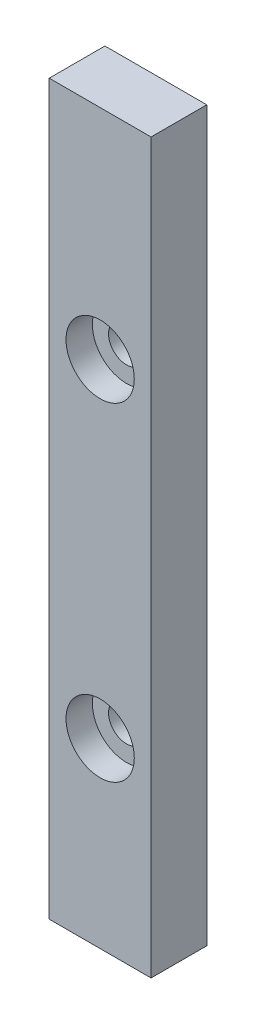
ISO-10303-21;
HEADER;
FILE_DESCRIPTION(('STEP AP214'),'2;1');
FILE_NAME('part.step','',(''),(''),'','','');
FILE_SCHEMA(('AUTOMOTIVE_DESIGN { 1 0 10303 214 1 1 1 1 }'));
ENDSEC;
DATA;
#1=APPLICATION_CONTEXT('core data for automotive mechanical design processes');
#2=APPLICATION_PROTOCOL_DEFINITION('international standard','automotive_design',2000,#1);
#3=PRODUCT_CONTEXT('',#1,'mechanical');
#4=PRODUCT('Part','Part','',(#3));
#5=PRODUCT_RELATED_PRODUCT_CATEGORY('part','',(#4));
#6=PRODUCT_DEFINITION_FORMATION('','',#4);
#7=PRODUCT_DEFINITION_CONTEXT('part definition',#1,'design');
#8=PRODUCT_DEFINITION('design','',#6,#7);
#9=PRODUCT_DEFINITION_SHAPE('','',#8);
#10=(LENGTH_UNIT() NAMED_UNIT(*) SI_UNIT(.MILLI.,.METRE.));
#11=(NAMED_UNIT(*) PLANE_ANGLE_UNIT() SI_UNIT($,.RADIAN.));
#12=(NAMED_UNIT(*) SI_UNIT($,.STERADIAN.) SOLID_ANGLE_UNIT());
#13=UNCERTAINTY_MEASURE_WITH_UNIT(LENGTH_MEASURE(1.E-05),#10,'distance_accuracy_value','');
#14=(GEOMETRIC_REPRESENTATION_CONTEXT(3) GLOBAL_UNCERTAINTY_ASSIGNED_CONTEXT((#13)) GLOBAL_UNIT_ASSIGNED_CONTEXT((#10,
#11,#12)) REPRESENTATION_CONTEXT('',''));
#15=CARTESIAN_POINT('',(0.,0.,0.));
#16=DIRECTION('',(0.,0.,1.));
#17=DIRECTION('',(1.,0.,0.));
#18=AXIS2_PLACEMENT_3D('',#15,#16,#17);
#19=CARTESIAN_POINT('',(4.25,-45.6,4.65));
#20=DIRECTION('',(0.,0.,1.));
#21=DIRECTION('',(1.,0.,0.));
#22=AXIS2_PLACEMENT_3D('',#19,#20,#21);
#23=CYLINDRICAL_SURFACE('',#22,1.5);
#24=CARTESIAN_POINT('',(4.25,-45.6,0.));
#25=DIRECTION('',(0.,0.,1.));
#26=DIRECTION('',(1.,0.,0.));
#27=AXIS2_PLACEMENT_3D('',#24,#25,#26);
#28=CIRCLE('',#27,1.5);
#29=CARTESIAN_POINT('',(5.75,-45.6,0.));
#30=VERTEX_POINT('',#29);
#31=EDGE_CURVE('E104',#30,#30,#28,.T.);
#32=ORIENTED_EDGE('',*,*,#31,.F.);
#33=EDGE_LOOP('',(#32));
#34=FACE_BOUND('',#33,.T.);
#35=CARTESIAN_POINT('',(4.25,-45.6,2.45));
#36=DIRECTION('',(0.,0.,1.));
#37=DIRECTION('',(1.,0.,0.));
#38=AXIS2_PLACEMENT_3D('',#35,#36,#37);
#39=CIRCLE('',#38,1.5);
#40=CARTESIAN_POINT('',(5.75,-45.6,2.45));
#41=VERTEX_POINT('',#40);
#42=EDGE_CURVE('E38',#41,#41,#39,.F.);
#43=ORIENTED_EDGE('',*,*,#42,.F.);
#44=EDGE_LOOP('',(#43));
#45=FACE_BOUND('',#44,.T.);
#46=ADVANCED_FACE('F34',(#34,#45),#23,.F.);
#47=CARTESIAN_POINT('',(4.25000000000001,-18.2,4.65));
#48=DIRECTION('',(0.,0.,1.));
#49=DIRECTION('',(1.,0.,0.));
#50=AXIS2_PLACEMENT_3D('',#47,#48,#49);
#51=CYLINDRICAL_SURFACE('',#50,1.5);
#52=CARTESIAN_POINT('',(4.25000000000001,-18.2,0.));
#53=DIRECTION('',(0.,0.,1.));
#54=DIRECTION('',(1.,0.,0.));
#55=AXIS2_PLACEMENT_3D('',#52,#53,#54);
#56=CIRCLE('',#55,1.5);
#57=CARTESIAN_POINT('',(5.75000000000001,-18.2,0.));
#58=VERTEX_POINT('',#57);
#59=EDGE_CURVE('E110',#58,#58,#56,.T.);
#60=ORIENTED_EDGE('',*,*,#59,.F.);
#61=EDGE_LOOP('',(#60));
#62=FACE_BOUND('',#61,.T.);
#63=CARTESIAN_POINT('',(4.25000000000001,-18.2,2.45));
#64=DIRECTION('',(0.,0.,1.));
#65=DIRECTION('',(1.,0.,0.));
#66=AXIS2_PLACEMENT_3D('',#63,#64,#65);
#67=CIRCLE('',#66,1.5);
#68=CARTESIAN_POINT('',(5.75000000000001,-18.2,2.45));
#69=VERTEX_POINT('',#68);
#70=EDGE_CURVE('E112',#69,#69,#67,.F.);
#71=ORIENTED_EDGE('',*,*,#70,.F.);
#72=EDGE_LOOP('',(#71));
#73=FACE_BOUND('',#72,.T.);
#74=ADVANCED_FACE('F140',(#62,#73),#51,.F.);
#75=CARTESIAN_POINT('',(0.,0.,4.65));
#76=DIRECTION('',(1.,0.,0.));
#77=DIRECTION('',(0.,1.,0.));
#78=AXIS2_PLACEMENT_3D('',#75,#76,#77);
#79=PLANE('',#78);
#80=DIRECTION('',(0.,-1.,0.));
#81=VECTOR('',#80,1.);
#82=CARTESIAN_POINT('',(0.,0.,0.));
#83=LINE('',#82,#81);
#84=CARTESIAN_POINT('',(0.,0.,0.));
#85=VERTEX_POINT('',#84);
#86=CARTESIAN_POINT('',(0.,-60.8,0.));
#87=VERTEX_POINT('',#86);
#88=EDGE_CURVE('E101',#85,#87,#83,.T.);
#89=ORIENTED_EDGE('',*,*,#88,.T.);
#90=DIRECTION('',(0.,0.,-1.));
#91=VECTOR('',#90,1.);
#92=CARTESIAN_POINT('',(0.,-60.8,4.65));
#93=LINE('',#92,#91);
#94=CARTESIAN_POINT('',(0.,-60.8,4.65));
#95=VERTEX_POINT('',#94);
#96=EDGE_CURVE('E11',#95,#87,#93,.T.);
#97=ORIENTED_EDGE('',*,*,#96,.F.);
#98=DIRECTION('',(0.,-1.,0.));
#99=VECTOR('',#98,1.);
#100=CARTESIAN_POINT('',(0.,0.,4.65));
#101=LINE('',#100,#99);
#102=CARTESIAN_POINT('',(0.,0.,4.65));
#103=VERTEX_POINT('',#102);
#104=EDGE_CURVE('E88',#103,#95,#101,.T.);
#105=ORIENTED_EDGE('',*,*,#104,.F.);
#106=DIRECTION('',(0.,0.,-1.));
#107=VECTOR('',#106,1.);
#108=CARTESIAN_POINT('',(0.,0.,4.65));
#109=LINE('',#108,#107);
#110=EDGE_CURVE('E97',#103,#85,#109,.T.);
#111=ORIENTED_EDGE('',*,*,#110,.T.);
#112=EDGE_LOOP('',(#89,#97,#105,#111));
#113=FACE_BOUND('',#112,.T.);
#114=ADVANCED_FACE('F36',(#113),#79,.F.);
#115=CARTESIAN_POINT('',(0.,-60.8,4.65));
#116=DIRECTION('',(0.,1.,0.));
#117=DIRECTION('',(0.,0.,1.));
#118=AXIS2_PLACEMENT_3D('',#115,#116,#117);
#119=PLANE('',#118);
#120=DIRECTION('',(1.,0.,0.));
#121=VECTOR('',#120,1.);
#122=CARTESIAN_POINT('',(0.,-60.8,0.));
#123=LINE('',#122,#121);
#124=CARTESIAN_POINT('',(8.50000000000001,-60.8,0.));
#125=VERTEX_POINT('',#124);
#126=EDGE_CURVE('E92',#87,#125,#123,.T.);
#127=ORIENTED_EDGE('',*,*,#126,.T.);
#128=DIRECTION('',(0.,0.,-1.));
#129=VECTOR('',#128,1.);
#130=CARTESIAN_POINT('',(8.50000000000001,-60.8,4.65));
#131=LINE('',#130,#129);
#132=CARTESIAN_POINT('',(8.50000000000001,-60.8,4.65));
#133=VERTEX_POINT('',#132);
#134=EDGE_CURVE('E44',#133,#125,#131,.T.);
#135=ORIENTED_EDGE('',*,*,#134,.F.);
#136=DIRECTION('',(1.,0.,0.));
#137=VECTOR('',#136,1.);
#138=CARTESIAN_POINT('',(0.,-60.8,4.65));
#139=LINE('',#138,#137);
#140=EDGE_CURVE('E83',#95,#133,#139,.T.);
#141=ORIENTED_EDGE('',*,*,#140,.F.);
#142=ORIENTED_EDGE('',*,*,#96,.T.);
#143=EDGE_LOOP('',(#127,#135,#141,#142));
#144=FACE_BOUND('',#143,.T.);
#145=ADVANCED_FACE('F91',(#144),#119,.F.);
#146=CARTESIAN_POINT('',(8.5,0.,4.65));
#147=DIRECTION('',(-1.,0.,0.));
#148=DIRECTION('',(0.,-1.,0.));
#149=AXIS2_PLACEMENT_3D('',#146,#147,#148);
#150=PLANE('',#149);
#151=DIRECTION('',(0.,1.,0.));
#152=VECTOR('',#151,1.);
#153=CARTESIAN_POINT('',(8.5,0.,0.));
#154=LINE('',#153,#152);
#155=CARTESIAN_POINT('',(8.5,0.,0.));
#156=VERTEX_POINT('',#155);
#157=EDGE_CURVE('E70',#125,#156,#154,.T.);
#158=ORIENTED_EDGE('',*,*,#157,.T.);
#159=DIRECTION('',(0.,0.,-1.));
#160=VECTOR('',#159,1.);
#161=CARTESIAN_POINT('',(8.5,0.,4.65));
#162=LINE('',#161,#160);
#163=CARTESIAN_POINT('',(8.5,0.,4.65));
#164=VERTEX_POINT('',#163);
#165=EDGE_CURVE('E93',#164,#156,#162,.T.);
#166=ORIENTED_EDGE('',*,*,#165,.F.);
#167=DIRECTION('',(0.,1.,0.));
#168=VECTOR('',#167,1.);
#169=CARTESIAN_POINT('',(8.5,0.,4.65));
#170=LINE('',#169,#168);
#171=EDGE_CURVE('E86',#133,#164,#170,.T.);
#172=ORIENTED_EDGE('',*,*,#171,.F.);
#173=ORIENTED_EDGE('',*,*,#134,.T.);
#174=EDGE_LOOP('',(#158,#166,#172,#173));
#175=FACE_BOUND('',#174,.T.);
#176=ADVANCED_FACE('F95',(#175),#150,.F.);
#177=CARTESIAN_POINT('',(0.,0.,4.65));
#178=DIRECTION('',(0.,-1.,0.));
#179=DIRECTION('',(0.,0.,-1.));
#180=AXIS2_PLACEMENT_3D('',#177,#178,#179);
#181=PLANE('',#180);
#182=DIRECTION('',(-1.,0.,0.));
#183=VECTOR('',#182,1.);
#184=CARTESIAN_POINT('',(0.,0.,0.));
#185=LINE('',#184,#183);
#186=EDGE_CURVE('E76',#156,#85,#185,.T.);
#187=ORIENTED_EDGE('',*,*,#186,.T.);
#188=ORIENTED_EDGE('',*,*,#110,.F.);
#189=DIRECTION('',(-1.,0.,0.));
#190=VECTOR('',#189,1.);
#191=CARTESIAN_POINT('',(0.,0.,4.65));
#192=LINE('',#191,#190);
#193=EDGE_CURVE('E53',#164,#103,#192,.T.);
#194=ORIENTED_EDGE('',*,*,#193,.F.);
#195=ORIENTED_EDGE('',*,*,#165,.T.);
#196=EDGE_LOOP('',(#187,#188,#194,#195));
#197=FACE_BOUND('',#196,.T.);
#198=ADVANCED_FACE('F166',(#197),#181,.F.);
#199=CARTESIAN_POINT('',(0.,0.,4.65));
#200=DIRECTION('',(0.,0.,1.));
#201=DIRECTION('',(1.,0.,0.));
#202=AXIS2_PLACEMENT_3D('',#199,#200,#201);
#203=PLANE('',#202);
#204=CARTESIAN_POINT('',(4.25000000000001,-18.2,4.65));
#205=DIRECTION('',(0.,0.,1.));
#206=DIRECTION('',(1.,0.,0.));
#207=AXIS2_PLACEMENT_3D('',#204,#205,#206);
#208=CIRCLE('',#207,2.85);
#209=CARTESIAN_POINT('',(7.10000000000001,-18.2,4.65));
#210=VERTEX_POINT('',#209);
#211=EDGE_CURVE('E119',#210,#210,#208,.T.);
#212=ORIENTED_EDGE('',*,*,#211,.F.);
#213=EDGE_LOOP('',(#212));
#214=FACE_BOUND('',#213,.T.);
#215=CARTESIAN_POINT('',(4.25,-45.6,4.65));
#216=DIRECTION('',(0.,0.,1.));
#217=DIRECTION('',(1.,0.,0.));
#218=AXIS2_PLACEMENT_3D('',#215,#216,#217);
#219=CIRCLE('',#218,2.85);
#220=CARTESIAN_POINT('',(7.1,-45.6,4.65));
#221=VERTEX_POINT('',#220);
#222=EDGE_CURVE('E129',#221,#221,#219,.T.);
#223=ORIENTED_EDGE('',*,*,#222,.F.);
#224=EDGE_LOOP('',(#223));
#225=FACE_BOUND('',#224,.T.);
#226=ORIENTED_EDGE('',*,*,#104,.T.);
#227=ORIENTED_EDGE('',*,*,#140,.T.);
#228=ORIENTED_EDGE('',*,*,#171,.T.);
#229=ORIENTED_EDGE('',*,*,#193,.T.);
#230=EDGE_LOOP('',(#226,#227,#228,#229));
#231=FACE_BOUND('',#230,.T.);
#232=ADVANCED_FACE('F84',(#214,#225,#231),#203,.T.);
#233=CARTESIAN_POINT('',(0.,0.,0.));
#234=DIRECTION('',(0.,0.,1.));
#235=DIRECTION('',(1.,0.,0.));
#236=AXIS2_PLACEMENT_3D('',#233,#234,#235);
#237=PLANE('',#236);
#238=ORIENTED_EDGE('',*,*,#59,.T.);
#239=EDGE_LOOP('',(#238));
#240=FACE_BOUND('',#239,.T.);
#241=ORIENTED_EDGE('',*,*,#31,.T.);
#242=EDGE_LOOP('',(#241));
#243=FACE_BOUND('',#242,.T.);
#244=ORIENTED_EDGE('',*,*,#88,.F.);
#245=ORIENTED_EDGE('',*,*,#186,.F.);
#246=ORIENTED_EDGE('',*,*,#157,.F.);
#247=ORIENTED_EDGE('',*,*,#126,.F.);
#248=EDGE_LOOP('',(#244,#245,#246,#247));
#249=FACE_BOUND('',#248,.T.);
#250=ADVANCED_FACE('F135',(#240,#243,#249),#237,.F.);
#251=CARTESIAN_POINT('',(4.25000000000001,-18.2,2.45));
#252=DIRECTION('',(0.,0.,1.));
#253=DIRECTION('',(1.,0.,0.));
#254=AXIS2_PLACEMENT_3D('',#251,#252,#253);
#255=PLANE('',#254);
#256=CARTESIAN_POINT('',(4.25000000000001,-18.2,2.45));
#257=DIRECTION('',(0.,0.,1.));
#258=DIRECTION('',(1.,0.,0.));
#259=AXIS2_PLACEMENT_3D('',#256,#257,#258);
#260=CIRCLE('',#259,2.85);
#261=CARTESIAN_POINT('',(7.10000000000001,-18.2,2.45));
#262=VERTEX_POINT('',#261);
#263=EDGE_CURVE('E114',#262,#262,#260,.T.);
#264=ORIENTED_EDGE('',*,*,#263,.T.);
#265=EDGE_LOOP('',(#264));
#266=FACE_BOUND('',#265,.T.);
#267=ORIENTED_EDGE('',*,*,#70,.T.);
#268=EDGE_LOOP('',(#267));
#269=FACE_BOUND('',#268,.T.);
#270=ADVANCED_FACE('F156',(#266,#269),#255,.T.);
#271=CARTESIAN_POINT('',(4.25000000000001,-18.2,2.45));
#272=DIRECTION('',(0.,0.,1.));
#273=DIRECTION('',(1.,0.,0.));
#274=AXIS2_PLACEMENT_3D('',#271,#272,#273);
#275=CYLINDRICAL_SURFACE('',#274,2.85);
#276=ORIENTED_EDGE('',*,*,#263,.F.);
#277=EDGE_LOOP('',(#276));
#278=FACE_BOUND('',#277,.T.);
#279=ORIENTED_EDGE('',*,*,#211,.T.);
#280=EDGE_LOOP('',(#279));
#281=FACE_BOUND('',#280,.T.);
#282=ADVANCED_FACE('F147',(#278,#281),#275,.F.);
#283=CARTESIAN_POINT('',(4.25,-45.6,2.45));
#284=DIRECTION('',(0.,0.,1.));
#285=DIRECTION('',(1.,0.,0.));
#286=AXIS2_PLACEMENT_3D('',#283,#284,#285);
#287=PLANE('',#286);
#288=CARTESIAN_POINT('',(4.25,-45.6,2.45));
#289=DIRECTION('',(0.,0.,1.));
#290=DIRECTION('',(1.,0.,0.));
#291=AXIS2_PLACEMENT_3D('',#288,#289,#290);
#292=CIRCLE('',#291,2.85);
#293=CARTESIAN_POINT('',(7.1,-45.6,2.45));
#294=VERTEX_POINT('',#293);
#295=EDGE_CURVE('E124',#294,#294,#292,.T.);
#296=ORIENTED_EDGE('',*,*,#295,.T.);
#297=EDGE_LOOP('',(#296));
#298=FACE_BOUND('',#297,.T.);
#299=ORIENTED_EDGE('',*,*,#42,.T.);
#300=EDGE_LOOP('',(#299));
#301=FACE_BOUND('',#300,.T.);
#302=ADVANCED_FACE('F144',(#298,#301),#287,.T.);
#303=CARTESIAN_POINT('',(4.25,-45.6,2.45));
#304=DIRECTION('',(0.,0.,1.));
#305=DIRECTION('',(1.,0.,0.));
#306=AXIS2_PLACEMENT_3D('',#303,#304,#305);
#307=CYLINDRICAL_SURFACE('',#306,2.85);
#308=ORIENTED_EDGE('',*,*,#295,.F.);
#309=EDGE_LOOP('',(#308));
#310=FACE_BOUND('',#309,.T.);
#311=ORIENTED_EDGE('',*,*,#222,.T.);
#312=EDGE_LOOP('',(#311));
#313=FACE_BOUND('',#312,.T.);
#314=ADVANCED_FACE('F146',(#310,#313),#307,.F.);
#315=CLOSED_SHELL('',(#46,#74,#114,#145,#176,#198,#232,#250,#270,#282,#302,#314));
#316=MANIFOLD_SOLID_BREP('B2',#315);
#317=ADVANCED_BREP_SHAPE_REPRESENTATION('',(#18,#316),#14);
#318=SHAPE_DEFINITION_REPRESENTATION(#9,#317);
ENDSEC;
END-ISO-10303-21;
